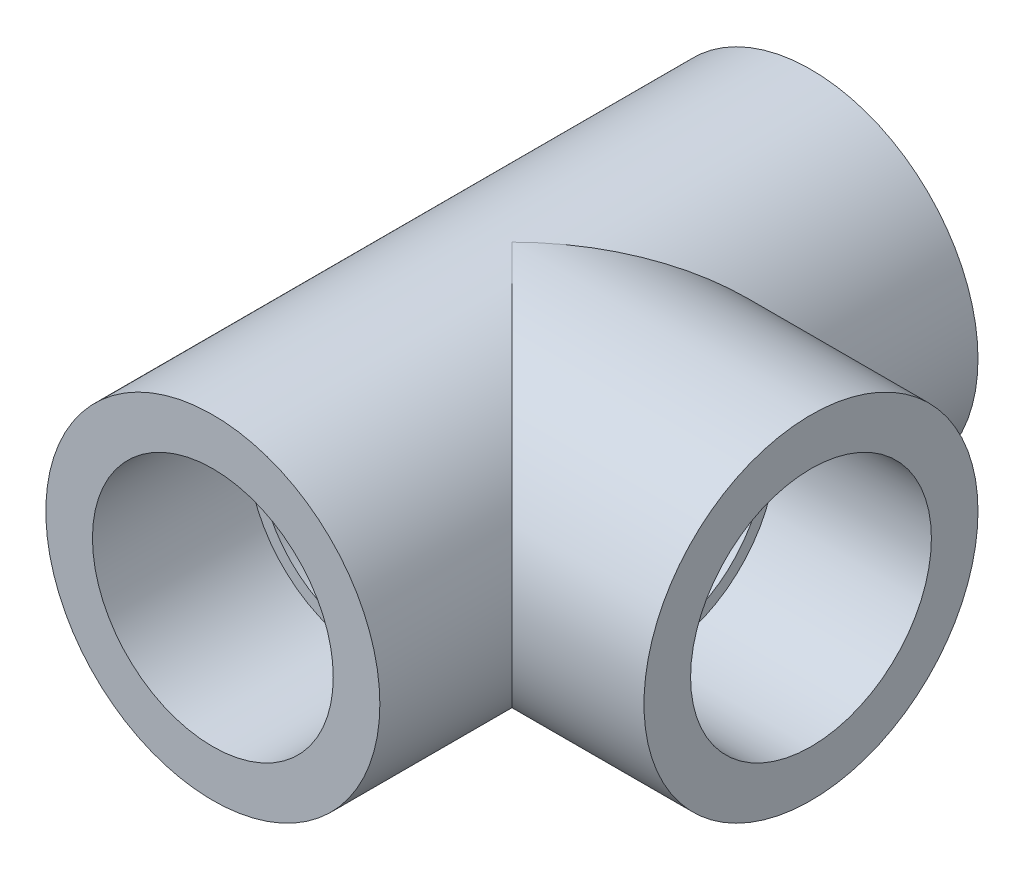
ISO-10303-21;
HEADER;
FILE_DESCRIPTION(('STEP AP214'),'2;1');
FILE_NAME('part.step','',(''),(''),'','','');
FILE_SCHEMA(('AUTOMOTIVE_DESIGN { 1 0 10303 214 1 1 1 1 }'));
ENDSEC;
DATA;
#1=APPLICATION_CONTEXT('core data for automotive mechanical design processes');
#2=APPLICATION_PROTOCOL_DEFINITION('international standard','automotive_design',2000,#1);
#3=PRODUCT_CONTEXT('',#1,'mechanical');
#4=PRODUCT('Part','Part','',(#3));
#5=PRODUCT_RELATED_PRODUCT_CATEGORY('part','',(#4));
#6=PRODUCT_DEFINITION_FORMATION('','',#4);
#7=PRODUCT_DEFINITION_CONTEXT('part definition',#1,'design');
#8=PRODUCT_DEFINITION('design','',#6,#7);
#9=PRODUCT_DEFINITION_SHAPE('','',#8);
#10=(LENGTH_UNIT() NAMED_UNIT(*) SI_UNIT(.MILLI.,.METRE.));
#11=(NAMED_UNIT(*) PLANE_ANGLE_UNIT() SI_UNIT($,.RADIAN.));
#12=(NAMED_UNIT(*) SI_UNIT($,.STERADIAN.) SOLID_ANGLE_UNIT());
#13=UNCERTAINTY_MEASURE_WITH_UNIT(LENGTH_MEASURE(1.E-05),#10,'distance_accuracy_value','');
#14=(GEOMETRIC_REPRESENTATION_CONTEXT(3) GLOBAL_UNCERTAINTY_ASSIGNED_CONTEXT((#13)) GLOBAL_UNIT_ASSIGNED_CONTEXT((#10,
#11,#12)) REPRESENTATION_CONTEXT('',''));
#15=CARTESIAN_POINT('',(0.,0.,0.));
#16=DIRECTION('',(0.,0.,1.));
#17=DIRECTION('',(1.,0.,0.));
#18=AXIS2_PLACEMENT_3D('',#15,#16,#17);
#19=CARTESIAN_POINT('',(0.,0.,38.5));
#20=DIRECTION('',(0.,0.,1.));
#21=DIRECTION('',(1.,0.,0.));
#22=AXIS2_PLACEMENT_3D('',#19,#20,#21);
#23=PLANE('',#22);
#24=CARTESIAN_POINT('',(0.,0.,38.5));
#25=DIRECTION('',(0.,0.,1.));
#26=DIRECTION('',(1.,0.,0.));
#27=AXIS2_PLACEMENT_3D('',#24,#25,#26);
#28=CIRCLE('',#27,21.5);
#29=CARTESIAN_POINT('',(21.5,0.,38.5));
#30=VERTEX_POINT('',#29);
#31=EDGE_CURVE('E13',#30,#30,#28,.T.);
#32=ORIENTED_EDGE('',*,*,#31,.T.);
#33=EDGE_LOOP('',(#32));
#34=FACE_BOUND('',#33,.T.);
#35=CARTESIAN_POINT('',(0.,0.,38.5));
#36=DIRECTION('',(0.,0.,-1.));
#37=DIRECTION('',(-1.,0.,0.));
#38=AXIS2_PLACEMENT_3D('',#35,#36,#37);
#39=CIRCLE('',#38,15.5);
#40=CARTESIAN_POINT('',(-15.5,0.,38.5));
#41=VERTEX_POINT('',#40);
#42=EDGE_CURVE('E102',#41,#41,#39,.T.);
#43=ORIENTED_EDGE('',*,*,#42,.T.);
#44=EDGE_LOOP('',(#43));
#45=FACE_BOUND('',#44,.T.);
#46=ADVANCED_FACE('F24',(#34,#45),#23,.T.);
#47=CARTESIAN_POINT('',(0.,0.,-38.5));
#48=DIRECTION('',(0.,0.,-1.));
#49=DIRECTION('',(-1.,0.,0.));
#50=AXIS2_PLACEMENT_3D('',#47,#48,#49);
#51=PLANE('',#50);
#52=CARTESIAN_POINT('',(0.,0.,-38.5));
#53=DIRECTION('',(0.,0.,-1.));
#54=DIRECTION('',(1.,0.,0.));
#55=AXIS2_PLACEMENT_3D('',#52,#53,#54);
#56=CIRCLE('',#55,21.5);
#57=CARTESIAN_POINT('',(21.5,0.,-38.5));
#58=VERTEX_POINT('',#57);
#59=EDGE_CURVE('E27',#58,#58,#56,.T.);
#60=ORIENTED_EDGE('',*,*,#59,.T.);
#61=EDGE_LOOP('',(#60));
#62=FACE_BOUND('',#61,.T.);
#63=CARTESIAN_POINT('',(0.,0.,-38.5));
#64=DIRECTION('',(0.,0.,1.));
#65=DIRECTION('',(1.,0.,0.));
#66=AXIS2_PLACEMENT_3D('',#63,#64,#65);
#67=CIRCLE('',#66,15.5);
#68=CARTESIAN_POINT('',(15.5,0.,-38.5));
#69=VERTEX_POINT('',#68);
#70=EDGE_CURVE('E88',#69,#69,#67,.T.);
#71=ORIENTED_EDGE('',*,*,#70,.T.);
#72=EDGE_LOOP('',(#71));
#73=FACE_BOUND('',#72,.T.);
#74=ADVANCED_FACE('F135',(#62,#73),#51,.T.);
#75=CARTESIAN_POINT('',(0.,0.,0.));
#76=DIRECTION('',(0.,0.,-1.));
#77=DIRECTION('',(1.,0.,0.));
#78=AXIS2_PLACEMENT_3D('',#75,#76,#77);
#79=CYLINDRICAL_SURFACE('',#78,21.5);
#80=ORIENTED_EDGE('',*,*,#31,.F.);
#81=EDGE_LOOP('',(#80));
#82=FACE_BOUND('',#81,.T.);
#83=ORIENTED_EDGE('',*,*,#59,.F.);
#84=EDGE_LOOP('',(#83));
#85=FACE_BOUND('',#84,.T.);
#86=CARTESIAN_POINT('',(0.,0.,0.));
#87=DIRECTION('',(-0.707106781186548,0.,0.707106781186548));
#88=DIRECTION('',(-0.707106781186548,0.,-0.707106781186548));
#89=AXIS2_PLACEMENT_3D('',#86,#87,#88);
#90=ELLIPSE('',#89,30.4055915910216,21.5);
#91=CARTESIAN_POINT('',(0.,-21.5,0.));
#92=VERTEX_POINT('',#91);
#93=CARTESIAN_POINT('',(0.,21.5,0.));
#94=VERTEX_POINT('',#93);
#95=EDGE_CURVE('E63',#92,#94,#90,.T.);
#96=ORIENTED_EDGE('',*,*,#95,.T.);
#97=CARTESIAN_POINT('',(0.,0.,0.));
#98=DIRECTION('',(-0.707106781186548,0.,-0.707106781186548));
#99=DIRECTION('',(0.707106781186548,0.,-0.707106781186548));
#100=AXIS2_PLACEMENT_3D('',#97,#98,#99);
#101=ELLIPSE('',#100,30.4055915910216,21.5);
#102=EDGE_CURVE('E121',#94,#92,#101,.T.);
#103=ORIENTED_EDGE('',*,*,#102,.T.);
#104=EDGE_LOOP('',(#96,#103));
#105=FACE_BOUND('',#104,.T.);
#106=ADVANCED_FACE('F133',(#82,#85,#105),#79,.T.);
#107=CARTESIAN_POINT('',(38.5,0.,0.));
#108=DIRECTION('',(1.,0.,0.));
#109=DIRECTION('',(0.,0.,-1.));
#110=AXIS2_PLACEMENT_3D('',#107,#108,#109);
#111=PLANE('',#110);
#112=CARTESIAN_POINT('',(38.5,0.,0.));
#113=DIRECTION('',(1.,0.,0.));
#114=DIRECTION('',(0.,0.,-1.));
#115=AXIS2_PLACEMENT_3D('',#112,#113,#114);
#116=CIRCLE('',#115,21.5);
#117=CARTESIAN_POINT('',(38.5,0.,-21.5));
#118=VERTEX_POINT('',#117);
#119=EDGE_CURVE('E120',#118,#118,#116,.T.);
#120=ORIENTED_EDGE('',*,*,#119,.T.);
#121=EDGE_LOOP('',(#120));
#122=FACE_BOUND('',#121,.T.);
#123=CARTESIAN_POINT('',(38.5,0.,0.));
#124=DIRECTION('',(-1.,0.,0.));
#125=DIRECTION('',(0.,0.,1.));
#126=AXIS2_PLACEMENT_3D('',#123,#124,#125);
#127=CIRCLE('',#126,15.5);
#128=CARTESIAN_POINT('',(38.5,0.,15.5));
#129=VERTEX_POINT('',#128);
#130=EDGE_CURVE('E116',#129,#129,#127,.T.);
#131=ORIENTED_EDGE('',*,*,#130,.T.);
#132=EDGE_LOOP('',(#131));
#133=FACE_BOUND('',#132,.T.);
#134=ADVANCED_FACE('F126',(#122,#133),#111,.T.);
#135=CARTESIAN_POINT('',(19.25,0.,0.));
#136=DIRECTION('',(-1.,0.,0.));
#137=DIRECTION('',(0.,0.,-1.));
#138=AXIS2_PLACEMENT_3D('',#135,#136,#137);
#139=CYLINDRICAL_SURFACE('',#138,21.5);
#140=ORIENTED_EDGE('',*,*,#119,.F.);
#141=EDGE_LOOP('',(#140));
#142=FACE_BOUND('',#141,.T.);
#143=ORIENTED_EDGE('',*,*,#102,.F.);
#144=ORIENTED_EDGE('',*,*,#95,.F.);
#145=EDGE_LOOP('',(#143,#144));
#146=FACE_BOUND('',#145,.T.);
#147=ADVANCED_FACE('F129',(#142,#146),#139,.T.);
#148=CARTESIAN_POINT('',(0.,0.,0.));
#149=DIRECTION('',(0.,0.,-1.));
#150=DIRECTION('',(1.,0.,0.));
#151=AXIS2_PLACEMENT_3D('',#148,#149,#150);
#152=CYLINDRICAL_SURFACE('',#151,14.);
#153=CARTESIAN_POINT('',(0.,0.,0.));
#154=DIRECTION('',(0.707106781186548,0.,-0.707106781186548));
#155=DIRECTION('',(-0.707106781186548,0.,-0.707106781186548));
#156=AXIS2_PLACEMENT_3D('',#153,#154,#155);
#157=ELLIPSE('',#156,19.7989898732233,14.);
#158=CARTESIAN_POINT('',(0.,14.,0.));
#159=VERTEX_POINT('',#158);
#160=CARTESIAN_POINT('',(0.,-14.,0.));
#161=VERTEX_POINT('',#160);
#162=EDGE_CURVE('E112',#159,#161,#157,.T.);
#163=ORIENTED_EDGE('',*,*,#162,.T.);
#164=CARTESIAN_POINT('',(0.,0.,0.));
#165=DIRECTION('',(0.707106781186548,0.,0.707106781186548));
#166=DIRECTION('',(0.707106781186548,0.,-0.707106781186548));
#167=AXIS2_PLACEMENT_3D('',#164,#165,#166);
#168=ELLIPSE('',#167,19.7989898732233,14.);
#169=EDGE_CURVE('E108',#161,#159,#168,.T.);
#170=ORIENTED_EDGE('',*,*,#169,.T.);
#171=EDGE_LOOP('',(#163,#170));
#172=FACE_BOUND('',#171,.T.);
#173=CARTESIAN_POINT('',(0.,0.,-18.5));
#174=DIRECTION('',(0.,0.,-1.));
#175=DIRECTION('',(1.,0.,0.));
#176=AXIS2_PLACEMENT_3D('',#173,#174,#175);
#177=CIRCLE('',#176,14.);
#178=CARTESIAN_POINT('',(-14.,0.,-18.5));
#179=VERTEX_POINT('',#178);
#180=EDGE_CURVE('E76',#179,#179,#177,.T.);
#181=ORIENTED_EDGE('',*,*,#180,.T.);
#182=EDGE_LOOP('',(#181));
#183=FACE_BOUND('',#182,.T.);
#184=CARTESIAN_POINT('',(0.,0.,18.5));
#185=DIRECTION('',(0.,0.,1.));
#186=DIRECTION('',(1.,0.,0.));
#187=AXIS2_PLACEMENT_3D('',#184,#185,#186);
#188=CIRCLE('',#187,14.);
#189=CARTESIAN_POINT('',(-14.,0.,18.5));
#190=VERTEX_POINT('',#189);
#191=EDGE_CURVE('E101',#190,#190,#188,.T.);
#192=ORIENTED_EDGE('',*,*,#191,.T.);
#193=EDGE_LOOP('',(#192));
#194=FACE_BOUND('',#193,.T.);
#195=ADVANCED_FACE('F131',(#172,#183,#194),#152,.F.);
#196=CARTESIAN_POINT('',(19.25,0.,0.));
#197=DIRECTION('',(-1.,0.,0.));
#198=DIRECTION('',(0.,0.,-1.));
#199=AXIS2_PLACEMENT_3D('',#196,#197,#198);
#200=CYLINDRICAL_SURFACE('',#199,14.);
#201=ORIENTED_EDGE('',*,*,#162,.F.);
#202=ORIENTED_EDGE('',*,*,#169,.F.);
#203=EDGE_LOOP('',(#201,#202));
#204=FACE_BOUND('',#203,.T.);
#205=CARTESIAN_POINT('',(18.5,0.,0.));
#206=DIRECTION('',(1.,0.,0.));
#207=DIRECTION('',(0.,0.,-1.));
#208=AXIS2_PLACEMENT_3D('',#205,#206,#207);
#209=CIRCLE('',#208,14.);
#210=CARTESIAN_POINT('',(18.5,0.,14.));
#211=VERTEX_POINT('',#210);
#212=EDGE_CURVE('E105',#211,#211,#209,.T.);
#213=ORIENTED_EDGE('',*,*,#212,.T.);
#214=EDGE_LOOP('',(#213));
#215=FACE_BOUND('',#214,.T.);
#216=ADVANCED_FACE('F168',(#204,#215),#200,.F.);
#217=CARTESIAN_POINT('',(0.,0.,-18.5));
#218=DIRECTION('',(0.,0.,1.));
#219=DIRECTION('',(1.,0.,0.));
#220=AXIS2_PLACEMENT_3D('',#217,#218,#219);
#221=PLANE('',#220);
#222=CARTESIAN_POINT('',(0.,0.,-18.5));
#223=DIRECTION('',(0.,0.,1.));
#224=DIRECTION('',(1.,0.,0.));
#225=AXIS2_PLACEMENT_3D('',#222,#223,#224);
#226=CIRCLE('',#225,15.5);
#227=CARTESIAN_POINT('',(15.5,0.,-18.5));
#228=VERTEX_POINT('',#227);
#229=EDGE_CURVE('E83',#228,#228,#226,.T.);
#230=ORIENTED_EDGE('',*,*,#229,.F.);
#231=EDGE_LOOP('',(#230));
#232=FACE_BOUND('',#231,.T.);
#233=ORIENTED_EDGE('',*,*,#180,.F.);
#234=EDGE_LOOP('',(#233));
#235=FACE_BOUND('',#234,.T.);
#236=ADVANCED_FACE('F165',(#232,#235),#221,.F.);
#237=CARTESIAN_POINT('',(0.,0.,-28.5));
#238=DIRECTION('',(0.,0.,-1.));
#239=DIRECTION('',(1.,0.,0.));
#240=AXIS2_PLACEMENT_3D('',#237,#238,#239);
#241=CYLINDRICAL_SURFACE('',#240,15.5);
#242=ORIENTED_EDGE('',*,*,#229,.T.);
#243=EDGE_LOOP('',(#242));
#244=FACE_BOUND('',#243,.T.);
#245=ORIENTED_EDGE('',*,*,#70,.F.);
#246=EDGE_LOOP('',(#245));
#247=FACE_BOUND('',#246,.T.);
#248=ADVANCED_FACE('F161',(#244,#247),#241,.F.);
#249=CARTESIAN_POINT('',(0.,0.,18.5));
#250=DIRECTION('',(0.,0.,-1.));
#251=DIRECTION('',(-1.,0.,0.));
#252=AXIS2_PLACEMENT_3D('',#249,#250,#251);
#253=PLANE('',#252);
#254=CARTESIAN_POINT('',(0.,0.,18.5));
#255=DIRECTION('',(0.,0.,-1.));
#256=DIRECTION('',(-1.,0.,0.));
#257=AXIS2_PLACEMENT_3D('',#254,#255,#256);
#258=CIRCLE('',#257,15.5);
#259=CARTESIAN_POINT('',(-15.5,0.,18.5));
#260=VERTEX_POINT('',#259);
#261=EDGE_CURVE('E97',#260,#260,#258,.T.);
#262=ORIENTED_EDGE('',*,*,#261,.F.);
#263=EDGE_LOOP('',(#262));
#264=FACE_BOUND('',#263,.T.);
#265=ORIENTED_EDGE('',*,*,#191,.F.);
#266=EDGE_LOOP('',(#265));
#267=FACE_BOUND('',#266,.T.);
#268=ADVANCED_FACE('F152',(#264,#267),#253,.F.);
#269=CARTESIAN_POINT('',(0.,0.,28.5));
#270=DIRECTION('',(0.,0.,1.));
#271=DIRECTION('',(-1.,0.,0.));
#272=AXIS2_PLACEMENT_3D('',#269,#270,#271);
#273=CYLINDRICAL_SURFACE('',#272,15.5);
#274=ORIENTED_EDGE('',*,*,#261,.T.);
#275=EDGE_LOOP('',(#274));
#276=FACE_BOUND('',#275,.T.);
#277=ORIENTED_EDGE('',*,*,#42,.F.);
#278=EDGE_LOOP('',(#277));
#279=FACE_BOUND('',#278,.T.);
#280=ADVANCED_FACE('F98',(#276,#279),#273,.F.);
#281=CARTESIAN_POINT('',(18.5,0.,0.));
#282=DIRECTION('',(-1.,0.,0.));
#283=DIRECTION('',(0.,0.,1.));
#284=AXIS2_PLACEMENT_3D('',#281,#282,#283);
#285=PLANE('',#284);
#286=CARTESIAN_POINT('',(18.5,0.,0.));
#287=DIRECTION('',(-1.,0.,0.));
#288=DIRECTION('',(0.,0.,1.));
#289=AXIS2_PLACEMENT_3D('',#286,#287,#288);
#290=CIRCLE('',#289,15.5);
#291=CARTESIAN_POINT('',(18.5,0.,15.5));
#292=VERTEX_POINT('',#291);
#293=EDGE_CURVE('E111',#292,#292,#290,.T.);
#294=ORIENTED_EDGE('',*,*,#293,.F.);
#295=EDGE_LOOP('',(#294));
#296=FACE_BOUND('',#295,.T.);
#297=ORIENTED_EDGE('',*,*,#212,.F.);
#298=EDGE_LOOP('',(#297));
#299=FACE_BOUND('',#298,.T.);
#300=ADVANCED_FACE('F151',(#296,#299),#285,.F.);
#301=CARTESIAN_POINT('',(28.5,0.,0.));
#302=DIRECTION('',(1.,0.,0.));
#303=DIRECTION('',(0.,0.,1.));
#304=AXIS2_PLACEMENT_3D('',#301,#302,#303);
#305=CYLINDRICAL_SURFACE('',#304,15.5);
#306=ORIENTED_EDGE('',*,*,#293,.T.);
#307=EDGE_LOOP('',(#306));
#308=FACE_BOUND('',#307,.T.);
#309=ORIENTED_EDGE('',*,*,#130,.F.);
#310=EDGE_LOOP('',(#309));
#311=FACE_BOUND('',#310,.T.);
#312=ADVANCED_FACE('F158',(#308,#311),#305,.F.);
#313=CLOSED_SHELL('',(#46,#74,#106,#134,#147,#195,#216,#236,#248,#268,#280,#300,#312));
#314=MANIFOLD_SOLID_BREP('B1',#313);
#315=ADVANCED_BREP_SHAPE_REPRESENTATION('',(#18,#314),#14);
#316=SHAPE_DEFINITION_REPRESENTATION(#9,#315);
ENDSEC;
END-ISO-10303-21;
